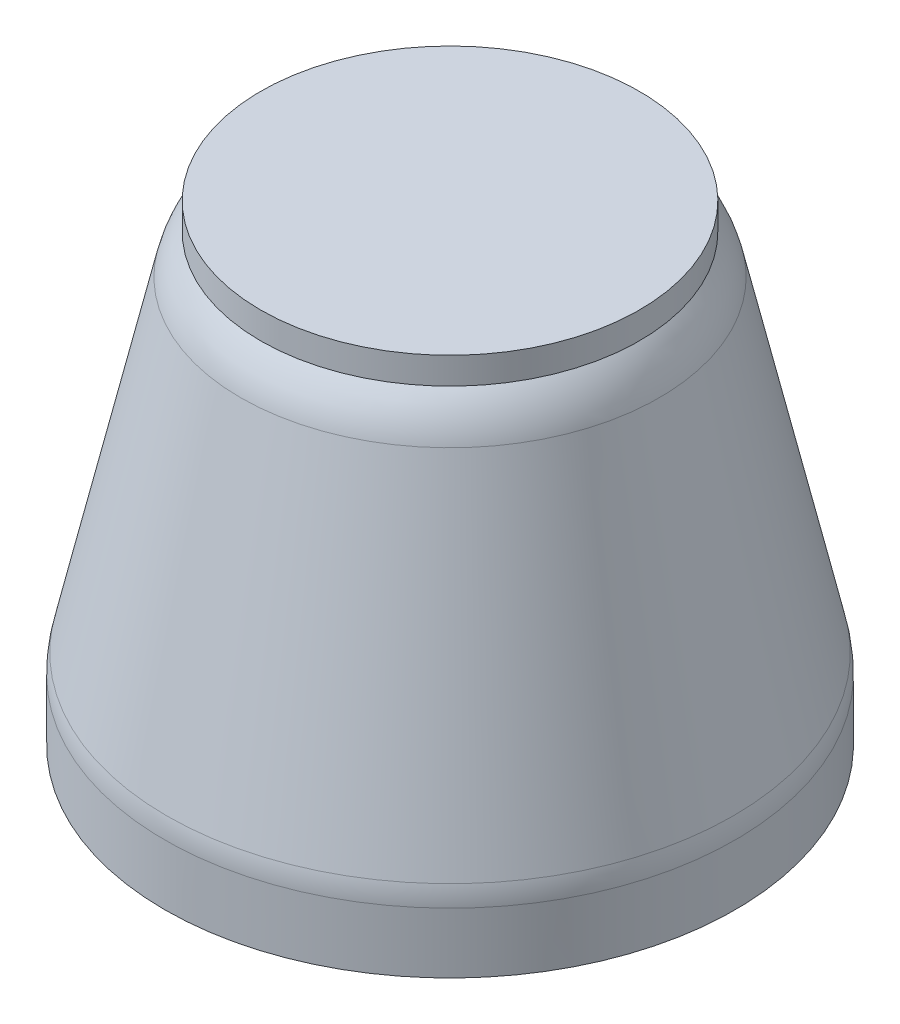
ISO-10303-21;
HEADER;
FILE_DESCRIPTION(('STEP AP214'),'2;1');
FILE_NAME('part.step','',(''),(''),'','','');
FILE_SCHEMA(('AUTOMOTIVE_DESIGN { 1 0 10303 214 1 1 1 1 }'));
ENDSEC;
DATA;
#1=APPLICATION_CONTEXT('core data for automotive mechanical design processes');
#2=APPLICATION_PROTOCOL_DEFINITION('international standard','automotive_design',2000,#1);
#3=PRODUCT_CONTEXT('',#1,'mechanical');
#4=PRODUCT('Part','Part','',(#3));
#5=PRODUCT_RELATED_PRODUCT_CATEGORY('part','',(#4));
#6=PRODUCT_DEFINITION_FORMATION('','',#4);
#7=PRODUCT_DEFINITION_CONTEXT('part definition',#1,'design');
#8=PRODUCT_DEFINITION('design','',#6,#7);
#9=PRODUCT_DEFINITION_SHAPE('','',#8);
#10=(LENGTH_UNIT() NAMED_UNIT(*) SI_UNIT(.MILLI.,.METRE.));
#11=(NAMED_UNIT(*) PLANE_ANGLE_UNIT() SI_UNIT($,.RADIAN.));
#12=(NAMED_UNIT(*) SI_UNIT($,.STERADIAN.) SOLID_ANGLE_UNIT());
#13=UNCERTAINTY_MEASURE_WITH_UNIT(LENGTH_MEASURE(1.E-05),#10,'distance_accuracy_value','');
#14=(GEOMETRIC_REPRESENTATION_CONTEXT(3) GLOBAL_UNCERTAINTY_ASSIGNED_CONTEXT((#13)) GLOBAL_UNIT_ASSIGNED_CONTEXT((#10,
#11,#12)) REPRESENTATION_CONTEXT('',''));
#15=CARTESIAN_POINT('',(0.,0.,0.));
#16=DIRECTION('',(0.,0.,1.));
#17=DIRECTION('',(1.,0.,0.));
#18=AXIS2_PLACEMENT_3D('',#15,#16,#17);
#19=CARTESIAN_POINT('',(0.,15.8,0.));
#20=DIRECTION('',(0.,-1.,0.));
#21=DIRECTION('',(0.,0.,-1.));
#22=AXIS2_PLACEMENT_3D('',#19,#20,#21);
#23=CYLINDRICAL_SURFACE('',#22,64.);
#24=CARTESIAN_POINT('',(0.,13.5663089692838,0.));
#25=DIRECTION('',(0.,-1.,0.));
#26=DIRECTION('',(0.,0.,-1.));
#27=AXIS2_PLACEMENT_3D('',#24,#25,#26);
#28=CIRCLE('',#27,64.);
#29=CARTESIAN_POINT('',(0.,13.5663089692838,-64.));
#30=VERTEX_POINT('',#29);
#31=EDGE_CURVE('E11',#30,#30,#28,.T.);
#32=ORIENTED_EDGE('',*,*,#31,.T.);
#33=EDGE_LOOP('',(#32));
#34=FACE_BOUND('',#33,.T.);
#35=CARTESIAN_POINT('',(0.,0.,0.));
#36=DIRECTION('',(0.,1.,0.));
#37=DIRECTION('',(0.,0.,1.));
#38=AXIS2_PLACEMENT_3D('',#35,#36,#37);
#39=CIRCLE('',#38,64.);
#40=CARTESIAN_POINT('',(0.,0.,64.));
#41=VERTEX_POINT('',#40);
#42=EDGE_CURVE('E50',#41,#41,#39,.T.);
#43=ORIENTED_EDGE('',*,*,#42,.T.);
#44=EDGE_LOOP('',(#43));
#45=FACE_BOUND('',#44,.T.);
#46=ADVANCED_FACE('F35',(#34,#45),#23,.T.);
#47=CARTESIAN_POINT('',(0.,0.,0.));
#48=DIRECTION('',(0.,1.,0.));
#49=DIRECTION('',(0.,0.,1.));
#50=AXIS2_PLACEMENT_3D('',#47,#48,#49);
#51=PLANE('',#50);
#52=CARTESIAN_POINT('',(0.,0.,0.));
#53=DIRECTION('',(0.,-1.,0.));
#54=DIRECTION('',(0.,0.,-1.));
#55=AXIS2_PLACEMENT_3D('',#52,#53,#54);
#56=CIRCLE('',#55,50.);
#57=CARTESIAN_POINT('',(0.,0.,-50.));
#58=VERTEX_POINT('',#57);
#59=EDGE_CURVE('E64',#58,#58,#56,.T.);
#60=ORIENTED_EDGE('',*,*,#59,.F.);
#61=EDGE_LOOP('',(#60));
#62=FACE_BOUND('',#61,.T.);
#63=ORIENTED_EDGE('',*,*,#42,.F.);
#64=EDGE_LOOP('',(#63));
#65=FACE_BOUND('',#64,.T.);
#66=ADVANCED_FACE('F70',(#62,#65),#51,.F.);
#67=CARTESIAN_POINT('',(0.,99.8,0.));
#68=DIRECTION('',(0.,-1.,0.));
#69=DIRECTION('',(0.,0.,-1.));
#70=AXIS2_PLACEMENT_3D('',#67,#68,#69);
#71=CONICAL_SURFACE('',#70,45.,0.222447265425942);
#72=CARTESIAN_POINT('',(0.,91.0034813089583,0.));
#73=DIRECTION('',(0.,-1.,0.));
#74=DIRECTION('',(0.,0.,-1.));
#75=AXIS2_PLACEMENT_3D('',#72,#73,#74);
#76=CIRCLE('',#75,46.9896887515452);
#77=CARTESIAN_POINT('',(0.,91.0034813089583,-46.9896887515452));
#78=VERTEX_POINT('',#77);
#79=EDGE_CURVE('E42',#78,#78,#76,.T.);
#80=ORIENTED_EDGE('',*,*,#79,.T.);
#81=EDGE_LOOP('',(#80));
#82=FACE_BOUND('',#81,.T.);
#83=CARTESIAN_POINT('',(0.,17.9786539149611,0.));
#84=DIRECTION('',(0.,-1.,0.));
#85=DIRECTION('',(0.,0.,-1.));
#86=AXIS2_PLACEMENT_3D('',#83,#84,#85);
#87=CIRCLE('',#86,63.5072092335207);
#88=CARTESIAN_POINT('',(0.,17.9786539149611,-63.5072092335207));
#89=VERTEX_POINT('',#88);
#90=EDGE_CURVE('E46',#89,#89,#87,.F.);
#91=ORIENTED_EDGE('',*,*,#90,.T.);
#92=EDGE_LOOP('',(#91));
#93=FACE_BOUND('',#92,.T.);
#94=ADVANCED_FACE('F73',(#82,#93),#71,.T.);
#95=CARTESIAN_POINT('',(0.,105.8,0.));
#96=DIRECTION('',(0.,-1.,0.));
#97=DIRECTION('',(0.,0.,-1.));
#98=AXIS2_PLACEMENT_3D('',#95,#96,#97);
#99=CYLINDRICAL_SURFACE('',#98,42.5);
#100=CARTESIAN_POINT('',(0.,105.8,0.));
#101=DIRECTION('',(0.,1.,0.));
#102=DIRECTION('',(0.,0.,1.));
#103=AXIS2_PLACEMENT_3D('',#100,#101,#102);
#104=CIRCLE('',#103,42.5);
#105=CARTESIAN_POINT('',(0.,105.8,42.5));
#106=VERTEX_POINT('',#105);
#107=EDGE_CURVE('E55',#106,#106,#104,.T.);
#108=ORIENTED_EDGE('',*,*,#107,.F.);
#109=EDGE_LOOP('',(#108));
#110=FACE_BOUND('',#109,.T.);
#111=CARTESIAN_POINT('',(0.,99.8,0.));
#112=DIRECTION('',(0.,1.,0.));
#113=DIRECTION('',(0.,0.,1.));
#114=AXIS2_PLACEMENT_3D('',#111,#112,#113);
#115=CIRCLE('',#114,42.5);
#116=CARTESIAN_POINT('',(0.,99.8,42.5));
#117=VERTEX_POINT('',#116);
#118=EDGE_CURVE('E56',#117,#117,#115,.T.);
#119=ORIENTED_EDGE('',*,*,#118,.T.);
#120=EDGE_LOOP('',(#119));
#121=FACE_BOUND('',#120,.T.);
#122=ADVANCED_FACE('F91',(#110,#121),#99,.T.);
#123=CARTESIAN_POINT('',(0.,105.8,0.));
#124=DIRECTION('',(0.,1.,0.));
#125=DIRECTION('',(0.,0.,1.));
#126=AXIS2_PLACEMENT_3D('',#123,#124,#125);
#127=PLANE('',#126);
#128=ORIENTED_EDGE('',*,*,#107,.T.);
#129=EDGE_LOOP('',(#128));
#130=FACE_BOUND('',#129,.T.);
#131=ADVANCED_FACE('F84',(#130),#127,.T.);
#132=CARTESIAN_POINT('',(0.,86.591136363281,0.));
#133=DIRECTION('',(0.,1.,0.));
#134=DIRECTION('',(0.,0.,1.));
#135=AXIS2_PLACEMENT_3D('',#132,#133,#134);
#136=TOROIDAL_SURFACE('',#135,27.4824795180244,20.);
#137=ORIENTED_EDGE('',*,*,#79,.F.);
#138=EDGE_LOOP('',(#137));
#139=FACE_BOUND('',#138,.T.);
#140=ORIENTED_EDGE('',*,*,#118,.F.);
#141=EDGE_LOOP('',(#140));
#142=FACE_BOUND('',#141,.T.);
#143=ADVANCED_FACE('F82',(#139,#142),#136,.T.);
#144=CARTESIAN_POINT('',(0.,13.5663089692838,0.));
#145=DIRECTION('',(0.,-1.,0.));
#146=DIRECTION('',(0.,0.,-1.));
#147=AXIS2_PLACEMENT_3D('',#144,#145,#146);
#148=TOROIDAL_SURFACE('',#147,44.,20.);
#149=ORIENTED_EDGE('',*,*,#31,.F.);
#150=EDGE_LOOP('',(#149));
#151=FACE_BOUND('',#150,.T.);
#152=ORIENTED_EDGE('',*,*,#90,.F.);
#153=EDGE_LOOP('',(#152));
#154=FACE_BOUND('',#153,.T.);
#155=ADVANCED_FACE('F37',(#151,#154),#148,.T.);
#156=CARTESIAN_POINT('',(0.,0.,0.));
#157=DIRECTION('',(0.,-1.,0.));
#158=DIRECTION('',(0.,0.,-1.));
#159=AXIS2_PLACEMENT_3D('',#156,#157,#158);
#160=CONICAL_SURFACE('',#159,50.,0.349065850398867);
#161=CARTESIAN_POINT('',(0.,6.,0.));
#162=DIRECTION('',(0.,-1.,0.));
#163=DIRECTION('',(0.,0.,-1.));
#164=AXIS2_PLACEMENT_3D('',#161,#162,#163);
#165=CIRCLE('',#164,47.8161785944028);
#166=CARTESIAN_POINT('',(0.,6.,-47.8161785944028));
#167=VERTEX_POINT('',#166);
#168=EDGE_CURVE('E59',#167,#167,#165,.T.);
#169=ORIENTED_EDGE('',*,*,#168,.F.);
#170=EDGE_LOOP('',(#169));
#171=FACE_BOUND('',#170,.T.);
#172=ORIENTED_EDGE('',*,*,#59,.T.);
#173=EDGE_LOOP('',(#172));
#174=FACE_BOUND('',#173,.T.);
#175=ADVANCED_FACE('F68',(#171,#174),#160,.F.);
#176=CARTESIAN_POINT('',(0.,6.,0.));
#177=DIRECTION('',(0.,-1.,0.));
#178=DIRECTION('',(0.,0.,-1.));
#179=AXIS2_PLACEMENT_3D('',#176,#177,#178);
#180=PLANE('',#179);
#181=ORIENTED_EDGE('',*,*,#168,.T.);
#182=EDGE_LOOP('',(#181));
#183=FACE_BOUND('',#182,.T.);
#184=ADVANCED_FACE('F107',(#183),#180,.T.);
#185=CLOSED_SHELL('',(#46,#66,#94,#122,#131,#143,#155,#175,#184));
#186=MANIFOLD_SOLID_BREP('B2',#185);
#187=ADVANCED_BREP_SHAPE_REPRESENTATION('',(#18,#186),#14);
#188=SHAPE_DEFINITION_REPRESENTATION(#9,#187);
ENDSEC;
END-ISO-10303-21;
